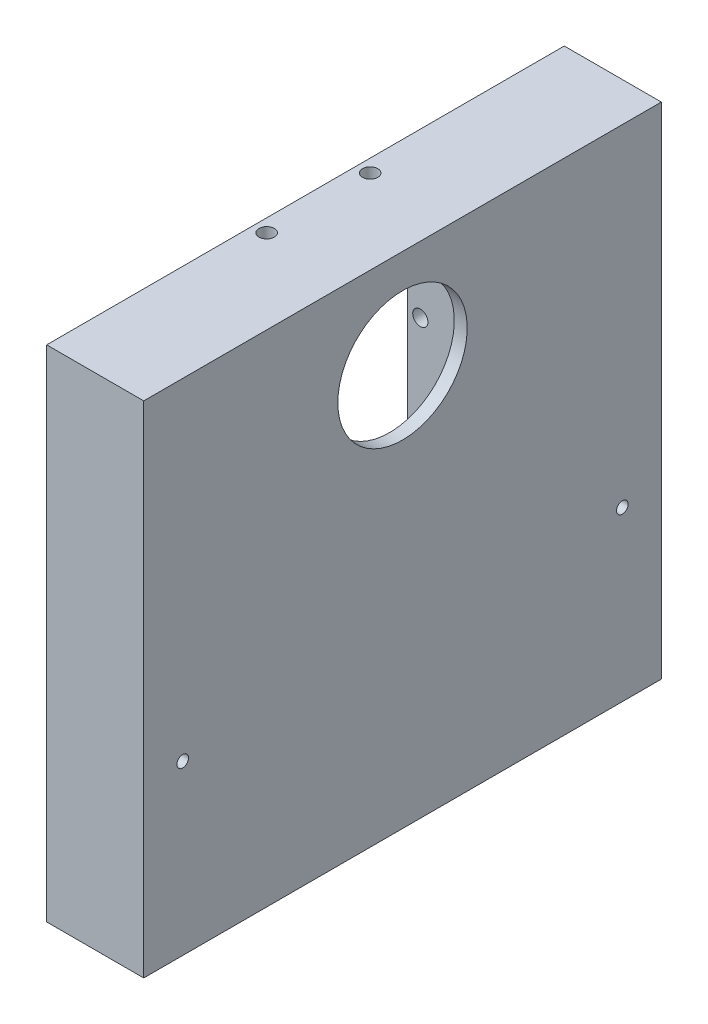
ISO-10303-21;
HEADER;
FILE_DESCRIPTION(('STEP AP214'),'2;1');
FILE_NAME('part.step','',(''),(''),'','','');
FILE_SCHEMA(('AUTOMOTIVE_DESIGN { 1 0 10303 214 1 1 1 1 }'));
ENDSEC;
DATA;
#1=APPLICATION_CONTEXT('core data for automotive mechanical design processes');
#2=APPLICATION_PROTOCOL_DEFINITION('international standard','automotive_design',2000,#1);
#3=PRODUCT_CONTEXT('',#1,'mechanical');
#4=PRODUCT('Part','Part','',(#3));
#5=PRODUCT_RELATED_PRODUCT_CATEGORY('part','',(#4));
#6=PRODUCT_DEFINITION_FORMATION('','',#4);
#7=PRODUCT_DEFINITION_CONTEXT('part definition',#1,'design');
#8=PRODUCT_DEFINITION('design','',#6,#7);
#9=PRODUCT_DEFINITION_SHAPE('','',#8);
#10=(LENGTH_UNIT() NAMED_UNIT(*) SI_UNIT(.MILLI.,.METRE.));
#11=(NAMED_UNIT(*) PLANE_ANGLE_UNIT() SI_UNIT($,.RADIAN.));
#12=(NAMED_UNIT(*) SI_UNIT($,.STERADIAN.) SOLID_ANGLE_UNIT());
#13=UNCERTAINTY_MEASURE_WITH_UNIT(LENGTH_MEASURE(1.E-05),#10,'distance_accuracy_value','');
#14=(GEOMETRIC_REPRESENTATION_CONTEXT(3) GLOBAL_UNCERTAINTY_ASSIGNED_CONTEXT((#13)) GLOBAL_UNIT_ASSIGNED_CONTEXT((#10,
#11,#12)) REPRESENTATION_CONTEXT('',''));
#15=CARTESIAN_POINT('',(0.,0.,0.));
#16=DIRECTION('',(0.,0.,1.));
#17=DIRECTION('',(1.,0.,0.));
#18=AXIS2_PLACEMENT_3D('',#15,#16,#17);
#19=CARTESIAN_POINT('',(17.,0.,0.));
#20=DIRECTION('',(-1.,0.,0.));
#21=DIRECTION('',(0.,0.,1.));
#22=AXIS2_PLACEMENT_3D('',#19,#20,#21);
#23=PLANE('',#22);
#24=CARTESIAN_POINT('',(17.,-0.750000000000001,-48.225));
#25=DIRECTION('',(-1.,0.,0.));
#26=DIRECTION('',(0.,0.,1.));
#27=AXIS2_PLACEMENT_3D('',#24,#25,#26);
#28=CIRCLE('',#27,0.899999999999997);
#29=CARTESIAN_POINT('',(17.,-0.750000000000001,-47.325));
#30=VERTEX_POINT('',#29);
#31=EDGE_CURVE('E711',#30,#30,#28,.T.);
#32=ORIENTED_EDGE('',*,*,#31,.F.);
#33=EDGE_LOOP('',(#32));
#34=FACE_BOUND('',#33,.T.);
#35=CARTESIAN_POINT('',(17.,-0.749999999999997,19.725));
#36=DIRECTION('',(-1.,0.,0.));
#37=DIRECTION('',(0.,0.,1.));
#38=AXIS2_PLACEMENT_3D('',#35,#36,#37);
#39=CIRCLE('',#38,0.899999999999997);
#40=CARTESIAN_POINT('',(17.,-0.749999999999997,20.625));
#41=VERTEX_POINT('',#40);
#42=EDGE_CURVE('E702',#41,#41,#39,.T.);
#43=ORIENTED_EDGE('',*,*,#42,.F.);
#44=EDGE_LOOP('',(#43));
#45=FACE_BOUND('',#44,.T.);
#46=DIRECTION('',(0.,-1.,0.));
#47=VECTOR('',#46,1.);
#48=CARTESIAN_POINT('',(17.,-4.,-32.5));
#49=LINE('',#48,#47);
#50=CARTESIAN_POINT('',(17.,46.5,-32.5));
#51=VERTEX_POINT('',#50);
#52=CARTESIAN_POINT('',(17.,-4.,-32.5));
#53=VERTEX_POINT('',#52);
#54=EDGE_CURVE('E283',#51,#53,#49,.T.);
#55=ORIENTED_EDGE('',*,*,#54,.F.);
#56=DIRECTION('',(0.,0.,-1.));
#57=VECTOR('',#56,1.);
#58=CARTESIAN_POINT('',(17.,46.5,-32.5));
#59=LINE('',#58,#57);
#60=CARTESIAN_POINT('',(17.,46.5,-50.25));
#61=VERTEX_POINT('',#60);
#62=EDGE_CURVE('E408',#51,#61,#59,.T.);
#63=ORIENTED_EDGE('',*,*,#62,.T.);
#64=DIRECTION('',(0.,-1.,0.));
#65=VECTOR('',#64,1.);
#66=CARTESIAN_POINT('',(17.,69.25,-50.25));
#67=LINE('',#66,#65);
#68=CARTESIAN_POINT('',(17.,-22.75,-50.25));
#69=VERTEX_POINT('',#68);
#70=EDGE_CURVE('E304',#61,#69,#67,.T.);
#71=ORIENTED_EDGE('',*,*,#70,.T.);
#72=DIRECTION('',(0.,0.,1.));
#73=VECTOR('',#72,1.);
#74=CARTESIAN_POINT('',(17.,-22.75,-50.25));
#75=LINE('',#74,#73);
#76=CARTESIAN_POINT('',(17.,-22.75,21.75));
#77=VERTEX_POINT('',#76);
#78=EDGE_CURVE('E306',#69,#77,#75,.T.);
#79=ORIENTED_EDGE('',*,*,#78,.T.);
#80=DIRECTION('',(0.,1.,0.));
#81=VECTOR('',#80,1.);
#82=CARTESIAN_POINT('',(17.,-22.75,21.75));
#83=LINE('',#82,#81);
#84=CARTESIAN_POINT('',(17.,46.5,21.75));
#85=VERTEX_POINT('',#84);
#86=EDGE_CURVE('E309',#77,#85,#83,.T.);
#87=ORIENTED_EDGE('',*,*,#86,.T.);
#88=DIRECTION('',(0.,0.,-1.));
#89=VECTOR('',#88,1.);
#90=CARTESIAN_POINT('',(17.,46.5,21.75));
#91=LINE('',#90,#89);
#92=CARTESIAN_POINT('',(17.,46.5,4.));
#93=VERTEX_POINT('',#92);
#94=EDGE_CURVE('E374',#85,#93,#91,.T.);
#95=ORIENTED_EDGE('',*,*,#94,.T.);
#96=DIRECTION('',(0.,1.,0.));
#97=VECTOR('',#96,1.);
#98=CARTESIAN_POINT('',(17.,50.5,4.));
#99=LINE('',#98,#97);
#100=CARTESIAN_POINT('',(17.,-4.,4.));
#101=VERTEX_POINT('',#100);
#102=EDGE_CURVE('E297',#101,#93,#99,.T.);
#103=ORIENTED_EDGE('',*,*,#102,.F.);
#104=DIRECTION('',(0.,0.,1.));
#105=VECTOR('',#104,1.);
#106=CARTESIAN_POINT('',(17.,-4.,4.));
#107=LINE('',#106,#105);
#108=EDGE_CURVE('E294',#53,#101,#107,.T.);
#109=ORIENTED_EDGE('',*,*,#108,.F.);
#110=EDGE_LOOP('',(#55,#63,#71,#79,#87,#95,#103,#109));
#111=FACE_BOUND('',#110,.T.);
#112=ADVANCED_FACE('F33',(#34,#45,#111),#23,.T.);
#113=CARTESIAN_POINT('',(17.,69.25,-50.25));
#114=DIRECTION('',(0.,0.,-1.));
#115=DIRECTION('',(-1.,0.,0.));
#116=AXIS2_PLACEMENT_3D('',#113,#114,#115);
#117=PLANE('',#116);
#118=DIRECTION('',(-1.,0.,0.));
#119=VECTOR('',#118,1.);
#120=CARTESIAN_POINT('',(17.,46.5,-50.25));
#121=LINE('',#120,#119);
#122=CARTESIAN_POINT('',(4.,46.5,-50.25));
#123=VERTEX_POINT('',#122);
#124=EDGE_CURVE('E381',#61,#123,#121,.T.);
#125=ORIENTED_EDGE('',*,*,#124,.T.);
#126=DIRECTION('',(0.,-1.,0.));
#127=VECTOR('',#126,1.);
#128=CARTESIAN_POINT('',(4.,69.25,-50.25));
#129=LINE('',#128,#127);
#130=CARTESIAN_POINT('',(3.99999999999999,-22.75,-50.25));
#131=VERTEX_POINT('',#130);
#132=EDGE_CURVE('E56',#123,#131,#129,.T.);
#133=ORIENTED_EDGE('',*,*,#132,.T.);
#134=DIRECTION('',(-1.,0.,0.));
#135=VECTOR('',#134,1.);
#136=CARTESIAN_POINT('',(17.,-22.75,-50.25));
#137=LINE('',#136,#135);
#138=EDGE_CURVE('E312',#69,#131,#137,.T.);
#139=ORIENTED_EDGE('',*,*,#138,.F.);
#140=ORIENTED_EDGE('',*,*,#70,.F.);
#141=EDGE_LOOP('',(#125,#133,#139,#140));
#142=FACE_BOUND('',#141,.T.);
#143=ADVANCED_FACE('F379',(#142),#117,.F.);
#144=CARTESIAN_POINT('',(0.,-4.,-32.5));
#145=DIRECTION('',(0.,0.,1.));
#146=DIRECTION('',(1.,0.,0.));
#147=AXIS2_PLACEMENT_3D('',#144,#145,#146);
#148=PLANE('',#147);
#149=CARTESIAN_POINT('',(6.,3.25,-32.5));
#150=DIRECTION('',(0.,0.,1.));
#151=DIRECTION('',(1.,0.,0.));
#152=AXIS2_PLACEMENT_3D('',#149,#150,#151);
#153=CIRCLE('',#152,1.175);
#154=CARTESIAN_POINT('',(7.175,3.25,-32.5));
#155=VERTEX_POINT('',#154);
#156=EDGE_CURVE('E246',#155,#155,#153,.T.);
#157=ORIENTED_EDGE('',*,*,#156,.T.);
#158=EDGE_LOOP('',(#157));
#159=FACE_BOUND('',#158,.T.);
#160=CARTESIAN_POINT('',(6.,27.25,-32.5));
#161=DIRECTION('',(0.,0.,1.));
#162=DIRECTION('',(1.,0.,0.));
#163=AXIS2_PLACEMENT_3D('',#160,#161,#162);
#164=CIRCLE('',#163,1.175);
#165=CARTESIAN_POINT('',(7.175,27.25,-32.5));
#166=VERTEX_POINT('',#165);
#167=EDGE_CURVE('E240',#166,#166,#164,.T.);
#168=ORIENTED_EDGE('',*,*,#167,.T.);
#169=EDGE_LOOP('',(#168));
#170=FACE_BOUND('',#169,.T.);
#171=DIRECTION('',(1.,0.,0.));
#172=VECTOR('',#171,1.);
#173=CARTESIAN_POINT('',(0.,-4.,-32.5));
#174=LINE('',#173,#172);
#175=CARTESIAN_POINT('',(3.99999999999999,-4.,-32.5));
#176=VERTEX_POINT('',#175);
#177=EDGE_CURVE('E302',#176,#53,#174,.T.);
#178=ORIENTED_EDGE('',*,*,#177,.F.);
#179=DIRECTION('',(0.,1.,0.));
#180=VECTOR('',#179,1.);
#181=CARTESIAN_POINT('',(3.99999999999999,-4.,-32.5));
#182=LINE('',#181,#180);
#183=CARTESIAN_POINT('',(4.,46.5,-32.5));
#184=VERTEX_POINT('',#183);
#185=EDGE_CURVE('E383',#176,#184,#182,.T.);
#186=ORIENTED_EDGE('',*,*,#185,.T.);
#187=DIRECTION('',(1.,0.,0.));
#188=VECTOR('',#187,1.);
#189=CARTESIAN_POINT('',(17.,46.5,-32.5));
#190=LINE('',#189,#188);
#191=EDGE_CURVE('E411',#184,#51,#190,.T.);
#192=ORIENTED_EDGE('',*,*,#191,.T.);
#193=ORIENTED_EDGE('',*,*,#54,.T.);
#194=EDGE_LOOP('',(#178,#186,#192,#193));
#195=FACE_BOUND('',#194,.T.);
#196=ADVANCED_FACE('F425',(#159,#170,#195),#148,.F.);
#197=CARTESIAN_POINT('',(17.,-22.75,21.75));
#198=DIRECTION('',(0.,0.,1.));
#199=DIRECTION('',(0.,-1.,0.));
#200=AXIS2_PLACEMENT_3D('',#197,#198,#199);
#201=PLANE('',#200);
#202=DIRECTION('',(-1.,0.,0.));
#203=VECTOR('',#202,1.);
#204=CARTESIAN_POINT('',(17.,-22.75,21.75));
#205=LINE('',#204,#203);
#206=CARTESIAN_POINT('',(3.99999999999999,-22.75,21.75));
#207=VERTEX_POINT('',#206);
#208=EDGE_CURVE('E313',#77,#207,#205,.T.);
#209=ORIENTED_EDGE('',*,*,#208,.T.);
#210=DIRECTION('',(0.,1.,0.));
#211=VECTOR('',#210,1.);
#212=CARTESIAN_POINT('',(3.99999999999999,-22.75,21.75));
#213=LINE('',#212,#211);
#214=CARTESIAN_POINT('',(4.,46.5,21.75));
#215=VERTEX_POINT('',#214);
#216=EDGE_CURVE('E362',#207,#215,#213,.T.);
#217=ORIENTED_EDGE('',*,*,#216,.T.);
#218=DIRECTION('',(1.,0.,0.));
#219=VECTOR('',#218,1.);
#220=CARTESIAN_POINT('',(17.,46.5,21.75));
#221=LINE('',#220,#219);
#222=EDGE_CURVE('E197',#215,#85,#221,.T.);
#223=ORIENTED_EDGE('',*,*,#222,.T.);
#224=ORIENTED_EDGE('',*,*,#86,.F.);
#225=EDGE_LOOP('',(#209,#217,#223,#224));
#226=FACE_BOUND('',#225,.T.);
#227=ADVANCED_FACE('F367',(#226),#201,.F.);
#228=CARTESIAN_POINT('',(0.,50.5,4.));
#229=DIRECTION('',(0.,0.,-1.));
#230=DIRECTION('',(-1.,0.,0.));
#231=AXIS2_PLACEMENT_3D('',#228,#229,#230);
#232=PLANE('',#231);
#233=CARTESIAN_POINT('',(6.,3.25,4.));
#234=DIRECTION('',(0.,0.,-1.));
#235=DIRECTION('',(-1.,0.,0.));
#236=AXIS2_PLACEMENT_3D('',#233,#234,#235);
#237=CIRCLE('',#236,1.175);
#238=CARTESIAN_POINT('',(4.825,3.25,4.));
#239=VERTEX_POINT('',#238);
#240=EDGE_CURVE('E222',#239,#239,#237,.T.);
#241=ORIENTED_EDGE('',*,*,#240,.T.);
#242=EDGE_LOOP('',(#241));
#243=FACE_BOUND('',#242,.T.);
#244=CARTESIAN_POINT('',(6.,27.25,4.));
#245=DIRECTION('',(0.,0.,-1.));
#246=DIRECTION('',(-1.,0.,0.));
#247=AXIS2_PLACEMENT_3D('',#244,#245,#246);
#248=CIRCLE('',#247,1.175);
#249=CARTESIAN_POINT('',(4.825,27.25,4.));
#250=VERTEX_POINT('',#249);
#251=EDGE_CURVE('E216',#250,#250,#248,.T.);
#252=ORIENTED_EDGE('',*,*,#251,.T.);
#253=EDGE_LOOP('',(#252));
#254=FACE_BOUND('',#253,.T.);
#255=DIRECTION('',(-1.,0.,0.));
#256=VECTOR('',#255,1.);
#257=CARTESIAN_POINT('',(17.,46.5,4.));
#258=LINE('',#257,#256);
#259=CARTESIAN_POINT('',(4.,46.5,4.));
#260=VERTEX_POINT('',#259);
#261=EDGE_CURVE('E414',#93,#260,#258,.T.);
#262=ORIENTED_EDGE('',*,*,#261,.T.);
#263=DIRECTION('',(0.,-1.,0.));
#264=VECTOR('',#263,1.);
#265=CARTESIAN_POINT('',(4.,50.5,4.));
#266=LINE('',#265,#264);
#267=CARTESIAN_POINT('',(3.99999999999999,-4.,4.));
#268=VERTEX_POINT('',#267);
#269=EDGE_CURVE('E390',#260,#268,#266,.T.);
#270=ORIENTED_EDGE('',*,*,#269,.T.);
#271=DIRECTION('',(1.,0.,0.));
#272=VECTOR('',#271,1.);
#273=CARTESIAN_POINT('',(0.,-4.,4.));
#274=LINE('',#273,#272);
#275=EDGE_CURVE('E300',#268,#101,#274,.T.);
#276=ORIENTED_EDGE('',*,*,#275,.T.);
#277=ORIENTED_EDGE('',*,*,#102,.T.);
#278=EDGE_LOOP('',(#262,#270,#276,#277));
#279=FACE_BOUND('',#278,.T.);
#280=ADVANCED_FACE('F417',(#243,#254,#279),#232,.F.);
#281=CARTESIAN_POINT('',(17.,-1.5,1.5));
#282=DIRECTION('',(0.,0.,1.));
#283=DIRECTION('',(1.,0.,0.));
#284=AXIS2_PLACEMENT_3D('',#281,#282,#283);
#285=PLANE('',#284);
#286=CARTESIAN_POINT('',(6.,3.25,1.5));
#287=DIRECTION('',(0.,0.,-1.));
#288=DIRECTION('',(-1.,0.,0.));
#289=AXIS2_PLACEMENT_3D('',#286,#287,#288);
#290=CIRCLE('',#289,1.175);
#291=CARTESIAN_POINT('',(4.825,3.25,1.5));
#292=VERTEX_POINT('',#291);
#293=EDGE_CURVE('E219',#292,#292,#290,.T.);
#294=ORIENTED_EDGE('',*,*,#293,.F.);
#295=EDGE_LOOP('',(#294));
#296=FACE_BOUND('',#295,.T.);
#297=DIRECTION('',(-1.,0.,0.));
#298=VECTOR('',#297,1.);
#299=CARTESIAN_POINT('',(17.,-1.5,1.5));
#300=LINE('',#299,#298);
#301=CARTESIAN_POINT('',(17.,-1.5,1.5));
#302=VERTEX_POINT('',#301);
#303=CARTESIAN_POINT('',(3.99999999999999,-1.5,1.5));
#304=VERTEX_POINT('',#303);
#305=EDGE_CURVE('E280',#302,#304,#300,.T.);
#306=ORIENTED_EDGE('',*,*,#305,.T.);
#307=DIRECTION('',(0.,1.,0.));
#308=VECTOR('',#307,1.);
#309=CARTESIAN_POINT('',(3.99999999999999,-1.5,1.5));
#310=LINE('',#309,#308);
#311=CARTESIAN_POINT('',(4.,48.,1.5));
#312=VERTEX_POINT('',#311);
#313=EDGE_CURVE('E405',#304,#312,#310,.T.);
#314=ORIENTED_EDGE('',*,*,#313,.T.);
#315=DIRECTION('',(-1.,0.,0.));
#316=VECTOR('',#315,1.);
#317=CARTESIAN_POINT('',(17.,48.,1.5));
#318=LINE('',#317,#316);
#319=CARTESIAN_POINT('',(17.,48.,1.5));
#320=VERTEX_POINT('',#319);
#321=EDGE_CURVE('E279',#320,#312,#318,.T.);
#322=ORIENTED_EDGE('',*,*,#321,.F.);
#323=DIRECTION('',(0.,1.,0.));
#324=VECTOR('',#323,1.);
#325=CARTESIAN_POINT('',(17.,-1.5,1.5));
#326=LINE('',#325,#324);
#327=EDGE_CURVE('E267',#302,#320,#326,.T.);
#328=ORIENTED_EDGE('',*,*,#327,.F.);
#329=EDGE_LOOP('',(#306,#314,#322,#328));
#330=FACE_BOUND('',#329,.T.);
#331=CARTESIAN_POINT('',(6.,27.25,1.5));
#332=DIRECTION('',(0.,0.,-1.));
#333=DIRECTION('',(-1.,0.,0.));
#334=AXIS2_PLACEMENT_3D('',#331,#332,#333);
#335=CIRCLE('',#334,1.175);
#336=CARTESIAN_POINT('',(4.825,27.25,1.5));
#337=VERTEX_POINT('',#336);
#338=EDGE_CURVE('E212',#337,#337,#335,.T.);
#339=ORIENTED_EDGE('',*,*,#338,.F.);
#340=EDGE_LOOP('',(#339));
#341=FACE_BOUND('',#340,.T.);
#342=ADVANCED_FACE('F650',(#296,#330,#341),#285,.F.);
#343=CARTESIAN_POINT('',(17.,48.,1.5));
#344=DIRECTION('',(0.,1.,0.));
#345=DIRECTION('',(0.,0.,1.));
#346=AXIS2_PLACEMENT_3D('',#343,#344,#345);
#347=PLANE('',#346);
#348=ORIENTED_EDGE('',*,*,#321,.T.);
#349=DIRECTION('',(0.,0.,-1.));
#350=VECTOR('',#349,1.);
#351=CARTESIAN_POINT('',(4.,48.,1.5));
#352=LINE('',#351,#350);
#353=CARTESIAN_POINT('',(4.,48.,-30.));
#354=VERTEX_POINT('',#353);
#355=EDGE_CURVE('E402',#312,#354,#352,.T.);
#356=ORIENTED_EDGE('',*,*,#355,.T.);
#357=DIRECTION('',(-1.,0.,0.));
#358=VECTOR('',#357,1.);
#359=CARTESIAN_POINT('',(17.,48.,-30.));
#360=LINE('',#359,#358);
#361=CARTESIAN_POINT('',(17.,48.,-30.));
#362=VERTEX_POINT('',#361);
#363=EDGE_CURVE('E287',#362,#354,#360,.T.);
#364=ORIENTED_EDGE('',*,*,#363,.F.);
#365=DIRECTION('',(0.,0.,-1.));
#366=VECTOR('',#365,1.);
#367=CARTESIAN_POINT('',(17.,48.,1.5));
#368=LINE('',#367,#366);
#369=EDGE_CURVE('E270',#320,#362,#368,.T.);
#370=ORIENTED_EDGE('',*,*,#369,.F.);
#371=EDGE_LOOP('',(#348,#356,#364,#370));
#372=FACE_BOUND('',#371,.T.);
#373=CARTESIAN_POINT('',(6.,48.,-22.25));
#374=DIRECTION('',(0.,-1.,0.));
#375=DIRECTION('',(0.,0.,-1.));
#376=AXIS2_PLACEMENT_3D('',#373,#374,#375);
#377=CIRCLE('',#376,1.175);
#378=CARTESIAN_POINT('',(6.,48.,-23.425));
#379=VERTEX_POINT('',#378);
#380=EDGE_CURVE('E231',#379,#379,#377,.T.);
#381=ORIENTED_EDGE('',*,*,#380,.F.);
#382=EDGE_LOOP('',(#381));
#383=FACE_BOUND('',#382,.T.);
#384=CARTESIAN_POINT('',(6.,48.,-6.25));
#385=DIRECTION('',(0.,-1.,0.));
#386=DIRECTION('',(0.,0.,-1.));
#387=AXIS2_PLACEMENT_3D('',#384,#385,#386);
#388=CIRCLE('',#387,1.175);
#389=CARTESIAN_POINT('',(6.,48.,-7.425));
#390=VERTEX_POINT('',#389);
#391=EDGE_CURVE('E225',#390,#390,#388,.T.);
#392=ORIENTED_EDGE('',*,*,#391,.F.);
#393=EDGE_LOOP('',(#392));
#394=FACE_BOUND('',#393,.T.);
#395=ADVANCED_FACE('F673',(#372,#383,#394),#347,.F.);
#396=CARTESIAN_POINT('',(19.,73.25,-54.25));
#397=DIRECTION('',(0.,0.,-1.));
#398=DIRECTION('',(0.,1.,0.));
#399=AXIS2_PLACEMENT_3D('',#396,#397,#398);
#400=PLANE('',#399);
#401=DIRECTION('',(0.,-1.,0.));
#402=VECTOR('',#401,1.);
#403=CARTESIAN_POINT('',(4.,50.5,-54.25));
#404=LINE('',#403,#402);
#405=CARTESIAN_POINT('',(4.,50.5,-54.25));
#406=VERTEX_POINT('',#405);
#407=CARTESIAN_POINT('',(3.99999999999999,-26.75,-54.25));
#408=VERTEX_POINT('',#407);
#409=EDGE_CURVE('E187',#406,#408,#404,.T.);
#410=ORIENTED_EDGE('',*,*,#409,.F.);
#411=DIRECTION('',(-1.,0.,0.));
#412=VECTOR('',#411,1.);
#413=CARTESIAN_POINT('',(102.171885273811,50.5,-54.25));
#414=LINE('',#413,#412);
#415=CARTESIAN_POINT('',(19.,50.5,-54.25));
#416=VERTEX_POINT('',#415);
#417=EDGE_CURVE('E186',#416,#406,#414,.T.);
#418=ORIENTED_EDGE('',*,*,#417,.F.);
#419=DIRECTION('',(0.,-1.,0.));
#420=VECTOR('',#419,1.);
#421=CARTESIAN_POINT('',(19.,73.25,-54.25));
#422=LINE('',#421,#420);
#423=CARTESIAN_POINT('',(19.,-26.75,-54.25));
#424=VERTEX_POINT('',#423);
#425=EDGE_CURVE('E316',#416,#424,#422,.T.);
#426=ORIENTED_EDGE('',*,*,#425,.T.);
#427=DIRECTION('',(-1.,0.,0.));
#428=VECTOR('',#427,1.);
#429=CARTESIAN_POINT('',(19.,-26.75,-54.25));
#430=LINE('',#429,#428);
#431=EDGE_CURVE('E324',#424,#408,#430,.T.);
#432=ORIENTED_EDGE('',*,*,#431,.T.);
#433=EDGE_LOOP('',(#410,#418,#426,#432));
#434=FACE_BOUND('',#433,.T.);
#435=ADVANCED_FACE('F35',(#434),#400,.T.);
#436=CARTESIAN_POINT('',(19.,-26.75,25.75));
#437=DIRECTION('',(0.,0.,1.));
#438=DIRECTION('',(0.,-1.,0.));
#439=AXIS2_PLACEMENT_3D('',#436,#437,#438);
#440=PLANE('',#439);
#441=DIRECTION('',(0.,-1.,0.));
#442=VECTOR('',#441,1.);
#443=CARTESIAN_POINT('',(4.,50.5,25.75));
#444=LINE('',#443,#442);
#445=CARTESIAN_POINT('',(4.,50.5,25.75));
#446=VERTEX_POINT('',#445);
#447=CARTESIAN_POINT('',(3.99999999999999,-26.75,25.75));
#448=VERTEX_POINT('',#447);
#449=EDGE_CURVE('E167',#446,#448,#444,.T.);
#450=ORIENTED_EDGE('',*,*,#449,.T.);
#451=DIRECTION('',(-1.,0.,0.));
#452=VECTOR('',#451,1.);
#453=CARTESIAN_POINT('',(19.,-26.75,25.75));
#454=LINE('',#453,#452);
#455=CARTESIAN_POINT('',(19.,-26.75,25.75));
#456=VERTEX_POINT('',#455);
#457=EDGE_CURVE('E325',#456,#448,#454,.T.);
#458=ORIENTED_EDGE('',*,*,#457,.F.);
#459=DIRECTION('',(0.,1.,0.));
#460=VECTOR('',#459,1.);
#461=CARTESIAN_POINT('',(19.,-26.75,25.75));
#462=LINE('',#461,#460);
#463=CARTESIAN_POINT('',(19.,50.5,25.75));
#464=VERTEX_POINT('',#463);
#465=EDGE_CURVE('E192',#456,#464,#462,.T.);
#466=ORIENTED_EDGE('',*,*,#465,.T.);
#467=DIRECTION('',(-1.,0.,0.));
#468=VECTOR('',#467,1.);
#469=CARTESIAN_POINT('',(102.171885273811,50.5,25.75));
#470=LINE('',#469,#468);
#471=EDGE_CURVE('E183',#464,#446,#470,.T.);
#472=ORIENTED_EDGE('',*,*,#471,.T.);
#473=EDGE_LOOP('',(#450,#458,#466,#472));
#474=FACE_BOUND('',#473,.T.);
#475=ADVANCED_FACE('F190',(#474),#440,.T.);
#476=CARTESIAN_POINT('',(19.,-26.75,-54.25));
#477=DIRECTION('',(0.,-1.,0.));
#478=DIRECTION('',(0.,0.,-1.));
#479=AXIS2_PLACEMENT_3D('',#476,#477,#478);
#480=PLANE('',#479);
#481=DIRECTION('',(0.,0.,-1.));
#482=VECTOR('',#481,1.);
#483=CARTESIAN_POINT('',(3.99999999999999,-26.75,103.103490548262));
#484=LINE('',#483,#482);
#485=CARTESIAN_POINT('',(3.99999999999999,-26.75,-32.5));
#486=VERTEX_POINT('',#485);
#487=EDGE_CURVE('E177',#486,#408,#484,.T.);
#488=ORIENTED_EDGE('',*,*,#487,.T.);
#489=ORIENTED_EDGE('',*,*,#431,.F.);
#490=DIRECTION('',(0.,0.,1.));
#491=VECTOR('',#490,1.);
#492=CARTESIAN_POINT('',(19.,-26.75,-54.25));
#493=LINE('',#492,#491);
#494=EDGE_CURVE('E320',#424,#456,#493,.T.);
#495=ORIENTED_EDGE('',*,*,#494,.T.);
#496=ORIENTED_EDGE('',*,*,#457,.T.);
#497=CARTESIAN_POINT('',(3.99999999999999,-26.75,4.));
#498=VERTEX_POINT('',#497);
#499=EDGE_CURVE('E173',#448,#498,#484,.T.);
#500=ORIENTED_EDGE('',*,*,#499,.T.);
#501=DIRECTION('',(-1.,0.,0.));
#502=VECTOR('',#501,1.);
#503=CARTESIAN_POINT('',(0.,-26.75,4.));
#504=LINE('',#503,#502);
#505=CARTESIAN_POINT('',(13.,-26.75,4.));
#506=VERTEX_POINT('',#505);
#507=EDGE_CURVE('E203',#506,#498,#504,.T.);
#508=ORIENTED_EDGE('',*,*,#507,.F.);
#509=DIRECTION('',(0.,0.,1.));
#510=VECTOR('',#509,1.);
#511=CARTESIAN_POINT('',(13.,-26.75,4.));
#512=LINE('',#511,#510);
#513=CARTESIAN_POINT('',(13.,-26.75,-32.5));
#514=VERTEX_POINT('',#513);
#515=EDGE_CURVE('E195',#514,#506,#512,.T.);
#516=ORIENTED_EDGE('',*,*,#515,.F.);
#517=DIRECTION('',(1.,0.,0.));
#518=VECTOR('',#517,1.);
#519=CARTESIAN_POINT('',(0.,-26.75,-32.5));
#520=LINE('',#519,#518);
#521=EDGE_CURVE('E206',#486,#514,#520,.T.);
#522=ORIENTED_EDGE('',*,*,#521,.F.);
#523=EDGE_LOOP('',(#488,#489,#495,#496,#500,#508,#516,#522));
#524=FACE_BOUND('',#523,.T.);
#525=ADVANCED_FACE('F352',(#524),#480,.T.);
#526=CARTESIAN_POINT('',(19.,0.,0.));
#527=DIRECTION('',(-1.,0.,0.));
#528=DIRECTION('',(0.,0.,1.));
#529=AXIS2_PLACEMENT_3D('',#526,#527,#528);
#530=PLANE('',#529);
#531=CARTESIAN_POINT('',(19.,-0.750000000000001,-48.225));
#532=DIRECTION('',(1.,0.,0.));
#533=DIRECTION('',(0.,0.,-1.));
#534=AXIS2_PLACEMENT_3D('',#531,#532,#533);
#535=CIRCLE('',#534,0.899999999999997);
#536=CARTESIAN_POINT('',(19.,-0.750000000000001,-49.125));
#537=VERTEX_POINT('',#536);
#538=EDGE_CURVE('E714',#537,#537,#535,.T.);
#539=ORIENTED_EDGE('',*,*,#538,.F.);
#540=EDGE_LOOP('',(#539));
#541=FACE_BOUND('',#540,.T.);
#542=CARTESIAN_POINT('',(19.,-0.749999999999997,19.725));
#543=DIRECTION('',(1.,0.,0.));
#544=DIRECTION('',(0.,0.,-1.));
#545=AXIS2_PLACEMENT_3D('',#542,#543,#544);
#546=CIRCLE('',#545,0.899999999999997);
#547=CARTESIAN_POINT('',(19.,-0.749999999999997,18.825));
#548=VERTEX_POINT('',#547);
#549=EDGE_CURVE('E705',#548,#548,#546,.T.);
#550=ORIENTED_EDGE('',*,*,#549,.F.);
#551=EDGE_LOOP('',(#550));
#552=FACE_BOUND('',#551,.T.);
#553=CARTESIAN_POINT('',(19.,35.25,-14.25));
#554=DIRECTION('',(-1.,0.,0.));
#555=DIRECTION('',(0.,0.,1.));
#556=AXIS2_PLACEMENT_3D('',#553,#554,#555);
#557=CIRCLE('',#556,9.99999999999999);
#558=CARTESIAN_POINT('',(19.,35.25,-4.25000000000001));
#559=VERTEX_POINT('',#558);
#560=EDGE_CURVE('E264',#559,#559,#557,.T.);
#561=ORIENTED_EDGE('',*,*,#560,.T.);
#562=EDGE_LOOP('',(#561));
#563=FACE_BOUND('',#562,.T.);
#564=ORIENTED_EDGE('',*,*,#425,.F.);
#565=DIRECTION('',(0.,0.,-1.));
#566=VECTOR('',#565,1.);
#567=CARTESIAN_POINT('',(19.,50.5,25.75));
#568=LINE('',#567,#566);
#569=EDGE_CURVE('E193',#464,#416,#568,.T.);
#570=ORIENTED_EDGE('',*,*,#569,.F.);
#571=ORIENTED_EDGE('',*,*,#465,.F.);
#572=ORIENTED_EDGE('',*,*,#494,.F.);
#573=EDGE_LOOP('',(#564,#570,#571,#572));
#574=FACE_BOUND('',#573,.T.);
#575=ADVANCED_FACE('F455',(#541,#552,#563,#574),#530,.F.);
#576=CARTESIAN_POINT('',(17.,-22.75,-50.25));
#577=DIRECTION('',(0.,-1.,0.));
#578=DIRECTION('',(0.,0.,-1.));
#579=AXIS2_PLACEMENT_3D('',#576,#577,#578);
#580=PLANE('',#579);
#581=ORIENTED_EDGE('',*,*,#138,.T.);
#582=DIRECTION('',(0.,0.,1.));
#583=VECTOR('',#582,1.);
#584=CARTESIAN_POINT('',(3.99999999999999,-22.75,-50.25));
#585=LINE('',#584,#583);
#586=CARTESIAN_POINT('',(3.99999999999999,-22.75,-32.5));
#587=VERTEX_POINT('',#586);
#588=EDGE_CURVE('E339',#131,#587,#585,.T.);
#589=ORIENTED_EDGE('',*,*,#588,.T.);
#590=DIRECTION('',(1.,0.,0.));
#591=VECTOR('',#590,1.);
#592=CARTESIAN_POINT('',(17.,-22.75,-32.5));
#593=LINE('',#592,#591);
#594=CARTESIAN_POINT('',(13.,-22.75,-32.5));
#595=VERTEX_POINT('',#594);
#596=EDGE_CURVE('E41',#587,#595,#593,.T.);
#597=ORIENTED_EDGE('',*,*,#596,.T.);
#598=DIRECTION('',(0.,0.,1.));
#599=VECTOR('',#598,1.);
#600=CARTESIAN_POINT('',(13.,-22.75,-50.25));
#601=LINE('',#600,#599);
#602=CARTESIAN_POINT('',(13.,-22.75,4.));
#603=VERTEX_POINT('',#602);
#604=EDGE_CURVE('E332',#595,#603,#601,.T.);
#605=ORIENTED_EDGE('',*,*,#604,.T.);
#606=DIRECTION('',(-1.,0.,0.));
#607=VECTOR('',#606,1.);
#608=CARTESIAN_POINT('',(17.,-22.75,4.));
#609=LINE('',#608,#607);
#610=CARTESIAN_POINT('',(3.99999999999999,-22.75,4.));
#611=VERTEX_POINT('',#610);
#612=EDGE_CURVE('E327',#603,#611,#609,.T.);
#613=ORIENTED_EDGE('',*,*,#612,.T.);
#614=EDGE_CURVE('E360',#611,#207,#585,.T.);
#615=ORIENTED_EDGE('',*,*,#614,.T.);
#616=ORIENTED_EDGE('',*,*,#208,.F.);
#617=ORIENTED_EDGE('',*,*,#78,.F.);
#618=EDGE_LOOP('',(#581,#589,#597,#605,#613,#615,#616,#617));
#619=FACE_BOUND('',#618,.T.);
#620=ADVANCED_FACE('F338',(#619),#580,.F.);
#621=CARTESIAN_POINT('',(0.,50.5,-32.5));
#622=DIRECTION('',(0.,-1.,0.));
#623=DIRECTION('',(0.,0.,-1.));
#624=AXIS2_PLACEMENT_3D('',#621,#622,#623);
#625=PLANE('',#624);
#626=ORIENTED_EDGE('',*,*,#417,.T.);
#627=DIRECTION('',(0.,0.,-1.));
#628=VECTOR('',#627,1.);
#629=CARTESIAN_POINT('',(4.,50.5,103.103490548262));
#630=LINE('',#629,#628);
#631=EDGE_CURVE('E170',#446,#406,#630,.T.);
#632=ORIENTED_EDGE('',*,*,#631,.F.);
#633=ORIENTED_EDGE('',*,*,#471,.F.);
#634=ORIENTED_EDGE('',*,*,#569,.T.);
#635=EDGE_LOOP('',(#626,#632,#633,#634));
#636=FACE_BOUND('',#635,.T.);
#637=CARTESIAN_POINT('',(6.,50.5,-6.25));
#638=DIRECTION('',(0.,-1.,0.));
#639=DIRECTION('',(0.,0.,-1.));
#640=AXIS2_PLACEMENT_3D('',#637,#638,#639);
#641=CIRCLE('',#640,1.175);
#642=CARTESIAN_POINT('',(6.,50.5,-7.425));
#643=VERTEX_POINT('',#642);
#644=EDGE_CURVE('E228',#643,#643,#641,.T.);
#645=ORIENTED_EDGE('',*,*,#644,.T.);
#646=EDGE_LOOP('',(#645));
#647=FACE_BOUND('',#646,.T.);
#648=CARTESIAN_POINT('',(6.,50.5,-22.25));
#649=DIRECTION('',(0.,-1.,0.));
#650=DIRECTION('',(0.,0.,-1.));
#651=AXIS2_PLACEMENT_3D('',#648,#649,#650);
#652=CIRCLE('',#651,1.175);
#653=CARTESIAN_POINT('',(6.,50.5,-23.425));
#654=VERTEX_POINT('',#653);
#655=EDGE_CURVE('E234',#654,#654,#652,.T.);
#656=ORIENTED_EDGE('',*,*,#655,.T.);
#657=EDGE_LOOP('',(#656));
#658=FACE_BOUND('',#657,.T.);
#659=ADVANCED_FACE('F181',(#636,#647,#658),#625,.F.);
#660=CARTESIAN_POINT('',(0.,-4.,4.));
#661=DIRECTION('',(0.,1.,0.));
#662=DIRECTION('',(0.,0.,1.));
#663=AXIS2_PLACEMENT_3D('',#660,#661,#662);
#664=PLANE('',#663);
#665=CARTESIAN_POINT('',(6.,-4.,-6.25));
#666=DIRECTION('',(0.,1.,0.));
#667=DIRECTION('',(0.,0.,1.));
#668=AXIS2_PLACEMENT_3D('',#665,#666,#667);
#669=CIRCLE('',#668,1.175);
#670=CARTESIAN_POINT('',(6.,-4.,-5.075));
#671=VERTEX_POINT('',#670);
#672=EDGE_CURVE('E252',#671,#671,#669,.T.);
#673=ORIENTED_EDGE('',*,*,#672,.T.);
#674=EDGE_LOOP('',(#673));
#675=FACE_BOUND('',#674,.T.);
#676=CARTESIAN_POINT('',(6.,-4.,-22.25));
#677=DIRECTION('',(0.,1.,0.));
#678=DIRECTION('',(0.,0.,1.));
#679=AXIS2_PLACEMENT_3D('',#676,#677,#678);
#680=CIRCLE('',#679,1.175);
#681=CARTESIAN_POINT('',(6.,-4.,-21.075));
#682=VERTEX_POINT('',#681);
#683=EDGE_CURVE('E258',#682,#682,#680,.T.);
#684=ORIENTED_EDGE('',*,*,#683,.T.);
#685=EDGE_LOOP('',(#684));
#686=FACE_BOUND('',#685,.T.);
#687=ORIENTED_EDGE('',*,*,#275,.F.);
#688=DIRECTION('',(0.,0.,-1.));
#689=VECTOR('',#688,1.);
#690=CARTESIAN_POINT('',(3.99999999999999,-4.,4.));
#691=LINE('',#690,#689);
#692=EDGE_CURVE('E382',#268,#176,#691,.T.);
#693=ORIENTED_EDGE('',*,*,#692,.T.);
#694=ORIENTED_EDGE('',*,*,#177,.T.);
#695=ORIENTED_EDGE('',*,*,#108,.T.);
#696=EDGE_LOOP('',(#687,#693,#694,#695));
#697=FACE_BOUND('',#696,.T.);
#698=ADVANCED_FACE('F423',(#675,#686,#697),#664,.F.);
#699=CARTESIAN_POINT('',(17.,-1.5,-30.));
#700=DIRECTION('',(0.,-1.,0.));
#701=DIRECTION('',(0.,0.,-1.));
#702=AXIS2_PLACEMENT_3D('',#699,#700,#701);
#703=PLANE('',#702);
#704=CARTESIAN_POINT('',(6.,-1.5,-6.25));
#705=DIRECTION('',(0.,1.,0.));
#706=DIRECTION('',(0.,0.,1.));
#707=AXIS2_PLACEMENT_3D('',#704,#705,#706);
#708=CIRCLE('',#707,1.175);
#709=CARTESIAN_POINT('',(6.,-1.5,-5.075));
#710=VERTEX_POINT('',#709);
#711=EDGE_CURVE('E249',#710,#710,#708,.T.);
#712=ORIENTED_EDGE('',*,*,#711,.F.);
#713=EDGE_LOOP('',(#712));
#714=FACE_BOUND('',#713,.T.);
#715=CARTESIAN_POINT('',(6.,-1.5,-22.25));
#716=DIRECTION('',(0.,1.,0.));
#717=DIRECTION('',(0.,0.,1.));
#718=AXIS2_PLACEMENT_3D('',#715,#716,#717);
#719=CIRCLE('',#718,1.175);
#720=CARTESIAN_POINT('',(6.,-1.5,-21.075));
#721=VERTEX_POINT('',#720);
#722=EDGE_CURVE('E255',#721,#721,#719,.T.);
#723=ORIENTED_EDGE('',*,*,#722,.F.);
#724=EDGE_LOOP('',(#723));
#725=FACE_BOUND('',#724,.T.);
#726=DIRECTION('',(-1.,0.,0.));
#727=VECTOR('',#726,1.);
#728=CARTESIAN_POINT('',(17.,-1.5,-30.));
#729=LINE('',#728,#727);
#730=CARTESIAN_POINT('',(17.,-1.5,-30.));
#731=VERTEX_POINT('',#730);
#732=CARTESIAN_POINT('',(4.,-1.5,-30.));
#733=VERTEX_POINT('',#732);
#734=EDGE_CURVE('E284',#731,#733,#729,.T.);
#735=ORIENTED_EDGE('',*,*,#734,.T.);
#736=DIRECTION('',(0.,0.,1.));
#737=VECTOR('',#736,1.);
#738=CARTESIAN_POINT('',(3.99999999999999,-1.5,-30.));
#739=LINE('',#738,#737);
#740=EDGE_CURVE('E48',#733,#304,#739,.T.);
#741=ORIENTED_EDGE('',*,*,#740,.T.);
#742=ORIENTED_EDGE('',*,*,#305,.F.);
#743=DIRECTION('',(0.,0.,1.));
#744=VECTOR('',#743,1.);
#745=CARTESIAN_POINT('',(17.,-1.5,-30.));
#746=LINE('',#745,#744);
#747=EDGE_CURVE('E276',#731,#302,#746,.T.);
#748=ORIENTED_EDGE('',*,*,#747,.F.);
#749=EDGE_LOOP('',(#735,#741,#742,#748));
#750=FACE_BOUND('',#749,.T.);
#751=ADVANCED_FACE('F487',(#714,#725,#750),#703,.F.);
#752=CARTESIAN_POINT('',(17.,48.,-30.));
#753=DIRECTION('',(0.,0.,-1.));
#754=DIRECTION('',(-1.,0.,0.));
#755=AXIS2_PLACEMENT_3D('',#752,#753,#754);
#756=PLANE('',#755);
#757=CARTESIAN_POINT('',(6.,27.25,-30.));
#758=DIRECTION('',(0.,0.,1.));
#759=DIRECTION('',(1.,0.,0.));
#760=AXIS2_PLACEMENT_3D('',#757,#758,#759);
#761=CIRCLE('',#760,1.175);
#762=CARTESIAN_POINT('',(7.175,27.25,-30.));
#763=VERTEX_POINT('',#762);
#764=EDGE_CURVE('E237',#763,#763,#761,.T.);
#765=ORIENTED_EDGE('',*,*,#764,.F.);
#766=EDGE_LOOP('',(#765));
#767=FACE_BOUND('',#766,.T.);
#768=CARTESIAN_POINT('',(6.,3.25,-30.));
#769=DIRECTION('',(0.,0.,1.));
#770=DIRECTION('',(1.,0.,0.));
#771=AXIS2_PLACEMENT_3D('',#768,#769,#770);
#772=CIRCLE('',#771,1.175);
#773=CARTESIAN_POINT('',(7.175,3.25,-30.));
#774=VERTEX_POINT('',#773);
#775=EDGE_CURVE('E243',#774,#774,#772,.T.);
#776=ORIENTED_EDGE('',*,*,#775,.F.);
#777=EDGE_LOOP('',(#776));
#778=FACE_BOUND('',#777,.T.);
#779=ORIENTED_EDGE('',*,*,#363,.T.);
#780=DIRECTION('',(0.,-1.,0.));
#781=VECTOR('',#780,1.);
#782=CARTESIAN_POINT('',(4.,48.,-30.));
#783=LINE('',#782,#781);
#784=EDGE_CURVE('E399',#354,#733,#783,.T.);
#785=ORIENTED_EDGE('',*,*,#784,.T.);
#786=ORIENTED_EDGE('',*,*,#734,.F.);
#787=DIRECTION('',(0.,-1.,0.));
#788=VECTOR('',#787,1.);
#789=CARTESIAN_POINT('',(17.,48.,-30.));
#790=LINE('',#789,#788);
#791=EDGE_CURVE('E273',#362,#731,#790,.T.);
#792=ORIENTED_EDGE('',*,*,#791,.F.);
#793=EDGE_LOOP('',(#779,#785,#786,#792));
#794=FACE_BOUND('',#793,.T.);
#795=ADVANCED_FACE('F495',(#767,#778,#794),#756,.F.);
#796=CARTESIAN_POINT('',(17.,0.,0.));
#797=DIRECTION('',(-1.,0.,0.));
#798=DIRECTION('',(0.,0.,1.));
#799=AXIS2_PLACEMENT_3D('',#796,#797,#798);
#800=PLANE('',#799);
#801=CARTESIAN_POINT('',(17.,35.25,-14.25));
#802=DIRECTION('',(-1.,0.,0.));
#803=DIRECTION('',(0.,0.,1.));
#804=AXIS2_PLACEMENT_3D('',#801,#802,#803);
#805=CIRCLE('',#804,9.99999999999999);
#806=CARTESIAN_POINT('',(17.,35.25,-4.25000000000001));
#807=VERTEX_POINT('',#806);
#808=EDGE_CURVE('E261',#807,#807,#805,.T.);
#809=ORIENTED_EDGE('',*,*,#808,.F.);
#810=EDGE_LOOP('',(#809));
#811=FACE_BOUND('',#810,.T.);
#812=ORIENTED_EDGE('',*,*,#327,.T.);
#813=ORIENTED_EDGE('',*,*,#369,.T.);
#814=ORIENTED_EDGE('',*,*,#791,.T.);
#815=ORIENTED_EDGE('',*,*,#747,.T.);
#816=EDGE_LOOP('',(#812,#813,#814,#815));
#817=FACE_BOUND('',#816,.T.);
#818=ADVANCED_FACE('F503',(#811,#817),#800,.T.);
#819=CARTESIAN_POINT('',(17.,35.25,-14.25));
#820=DIRECTION('',(-1.,0.,0.));
#821=DIRECTION('',(0.,0.,1.));
#822=AXIS2_PLACEMENT_3D('',#819,#820,#821);
#823=CYLINDRICAL_SURFACE('',#822,9.99999999999999);
#824=ORIENTED_EDGE('',*,*,#560,.F.);
#825=EDGE_LOOP('',(#824));
#826=FACE_BOUND('',#825,.T.);
#827=ORIENTED_EDGE('',*,*,#808,.T.);
#828=EDGE_LOOP('',(#827));
#829=FACE_BOUND('',#828,.T.);
#830=ADVANCED_FACE('F512',(#826,#829),#823,.F.);
#831=CARTESIAN_POINT('',(6.,-1.5,-22.25));
#832=DIRECTION('',(0.,1.,0.));
#833=DIRECTION('',(0.,0.,1.));
#834=AXIS2_PLACEMENT_3D('',#831,#832,#833);
#835=CYLINDRICAL_SURFACE('',#834,1.175);
#836=ORIENTED_EDGE('',*,*,#683,.F.);
#837=EDGE_LOOP('',(#836));
#838=FACE_BOUND('',#837,.T.);
#839=ORIENTED_EDGE('',*,*,#722,.T.);
#840=EDGE_LOOP('',(#839));
#841=FACE_BOUND('',#840,.T.);
#842=ADVANCED_FACE('F520',(#838,#841),#835,.F.);
#843=CARTESIAN_POINT('',(6.,-1.5,-6.25));
#844=DIRECTION('',(0.,1.,0.));
#845=DIRECTION('',(0.,0.,1.));
#846=AXIS2_PLACEMENT_3D('',#843,#844,#845);
#847=CYLINDRICAL_SURFACE('',#846,1.175);
#848=ORIENTED_EDGE('',*,*,#672,.F.);
#849=EDGE_LOOP('',(#848));
#850=FACE_BOUND('',#849,.T.);
#851=ORIENTED_EDGE('',*,*,#711,.T.);
#852=EDGE_LOOP('',(#851));
#853=FACE_BOUND('',#852,.T.);
#854=ADVANCED_FACE('F528',(#850,#853),#847,.F.);
#855=CARTESIAN_POINT('',(6.,3.25,-30.));
#856=DIRECTION('',(0.,0.,1.));
#857=DIRECTION('',(1.,0.,0.));
#858=AXIS2_PLACEMENT_3D('',#855,#856,#857);
#859=CYLINDRICAL_SURFACE('',#858,1.175);
#860=ORIENTED_EDGE('',*,*,#156,.F.);
#861=EDGE_LOOP('',(#860));
#862=FACE_BOUND('',#861,.T.);
#863=ORIENTED_EDGE('',*,*,#775,.T.);
#864=EDGE_LOOP('',(#863));
#865=FACE_BOUND('',#864,.T.);
#866=ADVANCED_FACE('F536',(#862,#865),#859,.F.);
#867=CARTESIAN_POINT('',(6.,27.25,-30.));
#868=DIRECTION('',(0.,0.,1.));
#869=DIRECTION('',(1.,0.,0.));
#870=AXIS2_PLACEMENT_3D('',#867,#868,#869);
#871=CYLINDRICAL_SURFACE('',#870,1.175);
#872=ORIENTED_EDGE('',*,*,#167,.F.);
#873=EDGE_LOOP('',(#872));
#874=FACE_BOUND('',#873,.T.);
#875=ORIENTED_EDGE('',*,*,#764,.T.);
#876=EDGE_LOOP('',(#875));
#877=FACE_BOUND('',#876,.T.);
#878=ADVANCED_FACE('F544',(#874,#877),#871,.F.);
#879=CARTESIAN_POINT('',(6.,48.,-22.25));
#880=DIRECTION('',(0.,-1.,0.));
#881=DIRECTION('',(0.,0.,-1.));
#882=AXIS2_PLACEMENT_3D('',#879,#880,#881);
#883=CYLINDRICAL_SURFACE('',#882,1.175);
#884=ORIENTED_EDGE('',*,*,#655,.F.);
#885=EDGE_LOOP('',(#884));
#886=FACE_BOUND('',#885,.T.);
#887=ORIENTED_EDGE('',*,*,#380,.T.);
#888=EDGE_LOOP('',(#887));
#889=FACE_BOUND('',#888,.T.);
#890=ADVANCED_FACE('F552',(#886,#889),#883,.F.);
#891=CARTESIAN_POINT('',(6.,48.,-6.25));
#892=DIRECTION('',(0.,-1.,0.));
#893=DIRECTION('',(0.,0.,-1.));
#894=AXIS2_PLACEMENT_3D('',#891,#892,#893);
#895=CYLINDRICAL_SURFACE('',#894,1.175);
#896=ORIENTED_EDGE('',*,*,#644,.F.);
#897=EDGE_LOOP('',(#896));
#898=FACE_BOUND('',#897,.T.);
#899=ORIENTED_EDGE('',*,*,#391,.T.);
#900=EDGE_LOOP('',(#899));
#901=FACE_BOUND('',#900,.T.);
#902=ADVANCED_FACE('F560',(#898,#901),#895,.F.);
#903=CARTESIAN_POINT('',(6.,3.25,1.5));
#904=DIRECTION('',(0.,0.,-1.));
#905=DIRECTION('',(-1.,0.,0.));
#906=AXIS2_PLACEMENT_3D('',#903,#904,#905);
#907=CYLINDRICAL_SURFACE('',#906,1.175);
#908=ORIENTED_EDGE('',*,*,#240,.F.);
#909=EDGE_LOOP('',(#908));
#910=FACE_BOUND('',#909,.T.);
#911=ORIENTED_EDGE('',*,*,#293,.T.);
#912=EDGE_LOOP('',(#911));
#913=FACE_BOUND('',#912,.T.);
#914=ADVANCED_FACE('F568',(#910,#913),#907,.F.);
#915=CARTESIAN_POINT('',(6.,27.25,1.5));
#916=DIRECTION('',(0.,0.,-1.));
#917=DIRECTION('',(-1.,0.,0.));
#918=AXIS2_PLACEMENT_3D('',#915,#916,#917);
#919=CYLINDRICAL_SURFACE('',#918,1.175);
#920=ORIENTED_EDGE('',*,*,#251,.F.);
#921=EDGE_LOOP('',(#920));
#922=FACE_BOUND('',#921,.T.);
#923=ORIENTED_EDGE('',*,*,#338,.T.);
#924=EDGE_LOOP('',(#923));
#925=FACE_BOUND('',#924,.T.);
#926=ADVANCED_FACE('F576',(#922,#925),#919,.F.);
#927=CARTESIAN_POINT('',(13.,-16.75,4.));
#928=DIRECTION('',(1.,0.,0.));
#929=DIRECTION('',(0.,0.,-1.));
#930=AXIS2_PLACEMENT_3D('',#927,#928,#929);
#931=PLANE('',#930);
#932=DIRECTION('',(0.,-1.,0.));
#933=VECTOR('',#932,1.);
#934=CARTESIAN_POINT('',(13.,-16.75,-32.5));
#935=LINE('',#934,#933);
#936=EDGE_CURVE('E209',#595,#514,#935,.T.);
#937=ORIENTED_EDGE('',*,*,#936,.T.);
#938=ORIENTED_EDGE('',*,*,#515,.T.);
#939=DIRECTION('',(0.,-1.,0.));
#940=VECTOR('',#939,1.);
#941=CARTESIAN_POINT('',(13.,-16.75,4.));
#942=LINE('',#941,#940);
#943=EDGE_CURVE('E208',#603,#506,#942,.T.);
#944=ORIENTED_EDGE('',*,*,#943,.F.);
#945=ORIENTED_EDGE('',*,*,#604,.F.);
#946=EDGE_LOOP('',(#937,#938,#944,#945));
#947=FACE_BOUND('',#946,.T.);
#948=ADVANCED_FACE('F345',(#947),#931,.F.);
#949=CARTESIAN_POINT('',(0.,-16.75,-32.5));
#950=DIRECTION('',(0.,0.,-1.));
#951=DIRECTION('',(-1.,0.,0.));
#952=AXIS2_PLACEMENT_3D('',#949,#950,#951);
#953=PLANE('',#952);
#954=ORIENTED_EDGE('',*,*,#596,.F.);
#955=DIRECTION('',(0.,-1.,0.));
#956=VECTOR('',#955,1.);
#957=CARTESIAN_POINT('',(3.99999999999999,-16.75,-32.5));
#958=LINE('',#957,#956);
#959=EDGE_CURVE('E349',#587,#486,#958,.T.);
#960=ORIENTED_EDGE('',*,*,#959,.T.);
#961=ORIENTED_EDGE('',*,*,#521,.T.);
#962=ORIENTED_EDGE('',*,*,#936,.F.);
#963=EDGE_LOOP('',(#954,#960,#961,#962));
#964=FACE_BOUND('',#963,.T.);
#965=ADVANCED_FACE('F347',(#964),#953,.F.);
#966=CARTESIAN_POINT('',(0.,-16.75,4.));
#967=DIRECTION('',(0.,0.,1.));
#968=DIRECTION('',(1.,0.,0.));
#969=AXIS2_PLACEMENT_3D('',#966,#967,#968);
#970=PLANE('',#969);
#971=ORIENTED_EDGE('',*,*,#507,.T.);
#972=DIRECTION('',(0.,1.,0.));
#973=VECTOR('',#972,1.);
#974=CARTESIAN_POINT('',(3.99999999999999,-16.75,4.));
#975=LINE('',#974,#973);
#976=EDGE_CURVE('E358',#498,#611,#975,.T.);
#977=ORIENTED_EDGE('',*,*,#976,.T.);
#978=ORIENTED_EDGE('',*,*,#612,.F.);
#979=ORIENTED_EDGE('',*,*,#943,.T.);
#980=EDGE_LOOP('',(#971,#977,#978,#979));
#981=FACE_BOUND('',#980,.T.);
#982=ADVANCED_FACE('F357',(#981),#970,.F.);
#983=CARTESIAN_POINT('',(0.,46.5,0.));
#984=DIRECTION('',(0.,1.,0.));
#985=DIRECTION('',(0.,0.,1.));
#986=AXIS2_PLACEMENT_3D('',#983,#984,#985);
#987=PLANE('',#986);
#988=ORIENTED_EDGE('',*,*,#222,.F.);
#989=DIRECTION('',(0.,0.,-1.));
#990=VECTOR('',#989,1.);
#991=CARTESIAN_POINT('',(4.,46.5,0.));
#992=LINE('',#991,#990);
#993=EDGE_CURVE('E393',#215,#260,#992,.T.);
#994=ORIENTED_EDGE('',*,*,#993,.T.);
#995=ORIENTED_EDGE('',*,*,#261,.F.);
#996=ORIENTED_EDGE('',*,*,#94,.F.);
#997=EDGE_LOOP('',(#988,#994,#995,#996));
#998=FACE_BOUND('',#997,.T.);
#999=ADVANCED_FACE('F420',(#998),#987,.F.);
#1000=CARTESIAN_POINT('',(0.,46.5,0.));
#1001=DIRECTION('',(0.,1.,0.));
#1002=DIRECTION('',(0.,0.,1.));
#1003=AXIS2_PLACEMENT_3D('',#1000,#1001,#1002);
#1004=PLANE('',#1003);
#1005=ORIENTED_EDGE('',*,*,#191,.F.);
#1006=DIRECTION('',(0.,0.,-1.));
#1007=VECTOR('',#1006,1.);
#1008=CARTESIAN_POINT('',(4.,46.5,0.));
#1009=LINE('',#1008,#1007);
#1010=EDGE_CURVE('E11',#184,#123,#1009,.T.);
#1011=ORIENTED_EDGE('',*,*,#1010,.T.);
#1012=ORIENTED_EDGE('',*,*,#124,.F.);
#1013=ORIENTED_EDGE('',*,*,#62,.F.);
#1014=EDGE_LOOP('',(#1005,#1011,#1012,#1013));
#1015=FACE_BOUND('',#1014,.T.);
#1016=ADVANCED_FACE('F430',(#1015),#1004,.F.);
#1017=CARTESIAN_POINT('',(4.,50.5,103.103490548262));
#1018=DIRECTION('',(1.,0.,0.));
#1019=DIRECTION('',(0.,1.,0.));
#1020=AXIS2_PLACEMENT_3D('',#1017,#1018,#1019);
#1021=PLANE('',#1020);
#1022=ORIENTED_EDGE('',*,*,#499,.F.);
#1023=ORIENTED_EDGE('',*,*,#449,.F.);
#1024=ORIENTED_EDGE('',*,*,#631,.T.);
#1025=ORIENTED_EDGE('',*,*,#409,.T.);
#1026=ORIENTED_EDGE('',*,*,#487,.F.);
#1027=ORIENTED_EDGE('',*,*,#959,.F.);
#1028=ORIENTED_EDGE('',*,*,#588,.F.);
#1029=ORIENTED_EDGE('',*,*,#132,.F.);
#1030=ORIENTED_EDGE('',*,*,#1010,.F.);
#1031=ORIENTED_EDGE('',*,*,#185,.F.);
#1032=ORIENTED_EDGE('',*,*,#692,.F.);
#1033=ORIENTED_EDGE('',*,*,#269,.F.);
#1034=ORIENTED_EDGE('',*,*,#993,.F.);
#1035=ORIENTED_EDGE('',*,*,#216,.F.);
#1036=ORIENTED_EDGE('',*,*,#614,.F.);
#1037=ORIENTED_EDGE('',*,*,#976,.F.);
#1038=EDGE_LOOP('',(#1022,#1023,#1024,#1025,#1026,#1027,#1028,#1029,#1030,#1031,#1032,#1033,
#1034,#1035,#1036,#1037));
#1039=FACE_BOUND('',#1038,.T.);
#1040=ORIENTED_EDGE('',*,*,#740,.F.);
#1041=ORIENTED_EDGE('',*,*,#784,.F.);
#1042=ORIENTED_EDGE('',*,*,#355,.F.);
#1043=ORIENTED_EDGE('',*,*,#313,.F.);
#1044=EDGE_LOOP('',(#1040,#1041,#1042,#1043));
#1045=FACE_BOUND('',#1044,.T.);
#1046=ADVANCED_FACE('F169',(#1039,#1045),#1021,.F.);
#1047=CARTESIAN_POINT('',(9.,-0.749999999999997,19.725));
#1048=DIRECTION('',(1.,0.,0.));
#1049=DIRECTION('',(0.,0.,-1.));
#1050=AXIS2_PLACEMENT_3D('',#1047,#1048,#1049);
#1051=CYLINDRICAL_SURFACE('',#1050,0.899999999999997);
#1052=ORIENTED_EDGE('',*,*,#42,.T.);
#1053=EDGE_LOOP('',(#1052));
#1054=FACE_BOUND('',#1053,.T.);
#1055=ORIENTED_EDGE('',*,*,#549,.T.);
#1056=EDGE_LOOP('',(#1055));
#1057=FACE_BOUND('',#1056,.T.);
#1058=ADVANCED_FACE('F437',(#1054,#1057),#1051,.F.);
#1059=CARTESIAN_POINT('',(9.,-0.750000000000001,-48.225));
#1060=DIRECTION('',(1.,0.,0.));
#1061=DIRECTION('',(0.,0.,-1.));
#1062=AXIS2_PLACEMENT_3D('',#1059,#1060,#1061);
#1063=CYLINDRICAL_SURFACE('',#1062,0.899999999999997);
#1064=ORIENTED_EDGE('',*,*,#31,.T.);
#1065=EDGE_LOOP('',(#1064));
#1066=FACE_BOUND('',#1065,.T.);
#1067=ORIENTED_EDGE('',*,*,#538,.T.);
#1068=EDGE_LOOP('',(#1067));
#1069=FACE_BOUND('',#1068,.T.);
#1070=ADVANCED_FACE('F718',(#1066,#1069),#1063,.F.);
#1071=CLOSED_SHELL('',(#112,#143,#196,#227,#280,#342,#395,#435,#475,#525,#575,#620,#659,#698,
#751,#795,#818,#830,#842,#854,#866,#878,#890,#902,#914,#926,#948,#965,#982,#999,#1016,#1046,
#1058,#1070));
#1072=MANIFOLD_SOLID_BREP('B2',#1071);
#1073=ADVANCED_BREP_SHAPE_REPRESENTATION('',(#18,#1072),#14);
#1074=SHAPE_DEFINITION_REPRESENTATION(#9,#1073);
ENDSEC;
END-ISO-10303-21;
